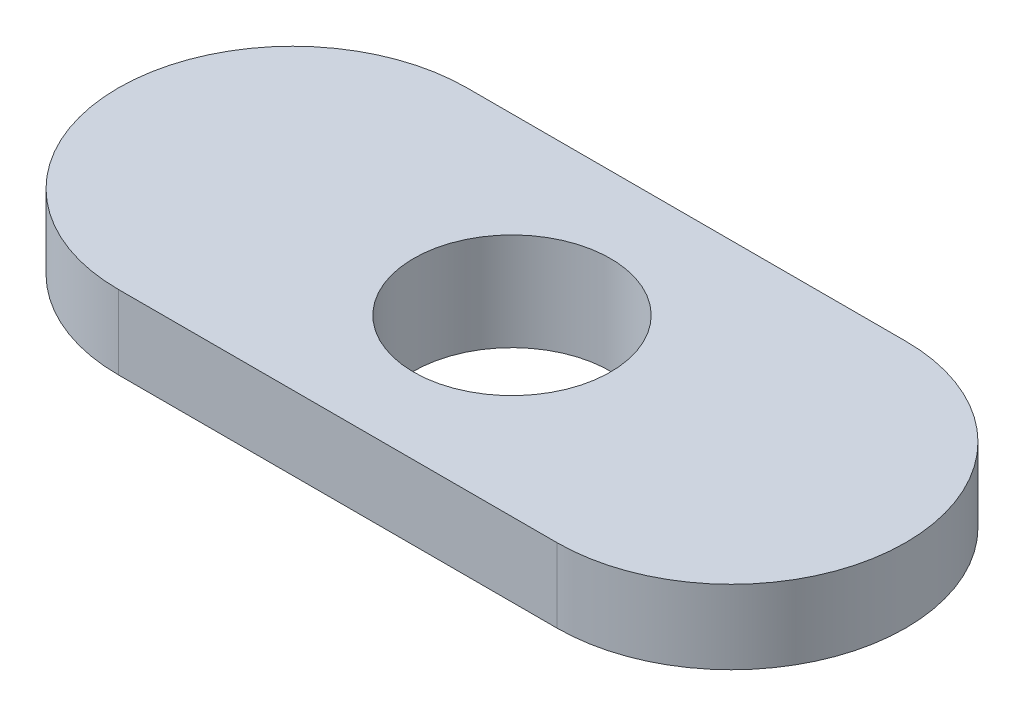
ISO-10303-21;
HEADER;
FILE_DESCRIPTION(('STEP AP214'),'2;1');
FILE_NAME('part.step','',(''),(''),'','','');
FILE_SCHEMA(('AUTOMOTIVE_DESIGN { 1 0 10303 214 1 1 1 1 }'));
ENDSEC;
DATA;
#1=APPLICATION_CONTEXT('core data for automotive mechanical design processes');
#2=APPLICATION_PROTOCOL_DEFINITION('international standard','automotive_design',2000,#1);
#3=PRODUCT_CONTEXT('',#1,'mechanical');
#4=PRODUCT('Part','Part','',(#3));
#5=PRODUCT_RELATED_PRODUCT_CATEGORY('part','',(#4));
#6=PRODUCT_DEFINITION_FORMATION('','',#4);
#7=PRODUCT_DEFINITION_CONTEXT('part definition',#1,'design');
#8=PRODUCT_DEFINITION('design','',#6,#7);
#9=PRODUCT_DEFINITION_SHAPE('','',#8);
#10=(LENGTH_UNIT() NAMED_UNIT(*) SI_UNIT(.MILLI.,.METRE.));
#11=(NAMED_UNIT(*) PLANE_ANGLE_UNIT() SI_UNIT($,.RADIAN.));
#12=(NAMED_UNIT(*) SI_UNIT($,.STERADIAN.) SOLID_ANGLE_UNIT());
#13=UNCERTAINTY_MEASURE_WITH_UNIT(LENGTH_MEASURE(1.E-05),#10,'distance_accuracy_value','');
#14=(GEOMETRIC_REPRESENTATION_CONTEXT(3) GLOBAL_UNCERTAINTY_ASSIGNED_CONTEXT((#13)) GLOBAL_UNIT_ASSIGNED_CONTEXT((#10,
#11,#12)) REPRESENTATION_CONTEXT('',''));
#15=CARTESIAN_POINT('',(0.,0.,0.));
#16=DIRECTION('',(0.,0.,1.));
#17=DIRECTION('',(1.,0.,0.));
#18=AXIS2_PLACEMENT_3D('',#15,#16,#17);
#19=CARTESIAN_POINT('',(0.,-9.4996,0.));
#20=DIRECTION('',(0.,1.,0.));
#21=DIRECTION('',(0.,0.,1.));
#22=AXIS2_PLACEMENT_3D('',#19,#20,#21);
#23=CYLINDRICAL_SURFACE('',#22,3.5687);
#24=CARTESIAN_POINT('',(0.,-9.4996,0.));
#25=DIRECTION('',(0.,1.,0.));
#26=DIRECTION('',(0.,0.,1.));
#27=AXIS2_PLACEMENT_3D('',#24,#25,#26);
#28=CIRCLE('',#27,3.5687);
#29=CARTESIAN_POINT('',(0.,-9.4996,3.5687));
#30=VERTEX_POINT('',#29);
#31=EDGE_CURVE('E21',#30,#30,#28,.F.);
#32=ORIENTED_EDGE('',*,*,#31,.F.);
#33=EDGE_LOOP('',(#32));
#34=FACE_BOUND('',#33,.T.);
#35=CARTESIAN_POINT('',(0.,-8.7376,0.));
#36=DIRECTION('',(0.,1.,0.));
#37=DIRECTION('',(0.,0.,1.));
#38=AXIS2_PLACEMENT_3D('',#35,#36,#37);
#39=CIRCLE('',#38,3.5687);
#40=CARTESIAN_POINT('',(0.,-8.7376,3.5687));
#41=VERTEX_POINT('',#40);
#42=EDGE_CURVE('E115',#41,#41,#39,.F.);
#43=ORIENTED_EDGE('',*,*,#42,.T.);
#44=EDGE_LOOP('',(#43));
#45=FACE_BOUND('',#44,.T.);
#46=ADVANCED_FACE('F18',(#34,#45),#23,.T.);
#47=CARTESIAN_POINT('',(0.,-9.4996,0.));
#48=DIRECTION('',(0.,-1.,0.));
#49=DIRECTION('',(0.,0.,-1.));
#50=AXIS2_PLACEMENT_3D('',#47,#48,#49);
#51=PLANE('',#50);
#52=CARTESIAN_POINT('',(0.,-9.4996,0.));
#53=DIRECTION('',(0.,1.,0.));
#54=DIRECTION('',(0.,0.,1.));
#55=AXIS2_PLACEMENT_3D('',#52,#53,#54);
#56=CIRCLE('',#55,3.175);
#57=CARTESIAN_POINT('',(0.,-9.4996,3.175));
#58=VERTEX_POINT('',#57);
#59=EDGE_CURVE('E77',#58,#58,#56,.T.);
#60=ORIENTED_EDGE('',*,*,#59,.T.);
#61=EDGE_LOOP('',(#60));
#62=FACE_BOUND('',#61,.T.);
#63=ORIENTED_EDGE('',*,*,#31,.T.);
#64=EDGE_LOOP('',(#63));
#65=FACE_BOUND('',#64,.T.);
#66=ADVANCED_FACE('F126',(#62,#65),#51,.T.);
#67=CARTESIAN_POINT('',(-7.0739,-8.7376,0.));
#68=DIRECTION('',(0.,1.,0.));
#69=DIRECTION('',(0.,0.,1.));
#70=AXIS2_PLACEMENT_3D('',#67,#68,#69);
#71=PLANE('',#70);
#72=ORIENTED_EDGE('',*,*,#42,.F.);
#73=EDGE_LOOP('',(#72));
#74=FACE_BOUND('',#73,.T.);
#75=DIRECTION('',(-1.,0.,0.));
#76=VECTOR('',#75,1.);
#77=CARTESIAN_POINT('',(-7.0739,-8.7376,-5.6261));
#78=LINE('',#77,#76);
#79=CARTESIAN_POINT('',(7.0739,-8.7376,-5.6261));
#80=VERTEX_POINT('',#79);
#81=CARTESIAN_POINT('',(-7.0739,-8.7376,-5.6261));
#82=VERTEX_POINT('',#81);
#83=EDGE_CURVE('E71',#80,#82,#78,.T.);
#84=ORIENTED_EDGE('',*,*,#83,.F.);
#85=CARTESIAN_POINT('',(7.0739,-8.7376,0.));
#86=DIRECTION('',(0.,1.,0.));
#87=DIRECTION('',(0.,0.,1.));
#88=AXIS2_PLACEMENT_3D('',#85,#86,#87);
#89=CIRCLE('',#88,5.6261);
#90=CARTESIAN_POINT('',(7.0739,-8.7376,5.6261));
#91=VERTEX_POINT('',#90);
#92=EDGE_CURVE('E95',#91,#80,#89,.T.);
#93=ORIENTED_EDGE('',*,*,#92,.F.);
#94=DIRECTION('',(1.,0.,0.));
#95=VECTOR('',#94,1.);
#96=CARTESIAN_POINT('',(-7.0739,-8.7376,5.6261));
#97=LINE('',#96,#95);
#98=CARTESIAN_POINT('',(-7.0739,-8.7376,5.6261));
#99=VERTEX_POINT('',#98);
#100=EDGE_CURVE('E72',#99,#91,#97,.T.);
#101=ORIENTED_EDGE('',*,*,#100,.F.);
#102=CARTESIAN_POINT('',(-7.0739,-8.7376,0.));
#103=DIRECTION('',(0.,1.,0.));
#104=DIRECTION('',(0.,0.,1.));
#105=AXIS2_PLACEMENT_3D('',#102,#103,#104);
#106=CIRCLE('',#105,5.6261);
#107=EDGE_CURVE('E66',#82,#99,#106,.T.);
#108=ORIENTED_EDGE('',*,*,#107,.F.);
#109=EDGE_LOOP('',(#84,#93,#101,#108));
#110=FACE_BOUND('',#109,.T.);
#111=ADVANCED_FACE('F68',(#74,#110),#71,.F.);
#112=CARTESIAN_POINT('',(0.,-8.7376,0.));
#113=DIRECTION('',(0.,1.,0.));
#114=DIRECTION('',(0.,0.,1.));
#115=AXIS2_PLACEMENT_3D('',#112,#113,#114);
#116=CYLINDRICAL_SURFACE('',#115,3.175);
#117=CARTESIAN_POINT('',(0.,-6.35,0.));
#118=DIRECTION('',(0.,1.,0.));
#119=DIRECTION('',(0.,0.,1.));
#120=AXIS2_PLACEMENT_3D('',#117,#118,#119);
#121=CIRCLE('',#120,3.175);
#122=CARTESIAN_POINT('',(0.,-6.35,3.175));
#123=VERTEX_POINT('',#122);
#124=EDGE_CURVE('E86',#123,#123,#121,.F.);
#125=ORIENTED_EDGE('',*,*,#124,.F.);
#126=EDGE_LOOP('',(#125));
#127=FACE_BOUND('',#126,.T.);
#128=ORIENTED_EDGE('',*,*,#59,.F.);
#129=EDGE_LOOP('',(#128));
#130=FACE_BOUND('',#129,.T.);
#131=ADVANCED_FACE('F153',(#127,#130),#116,.F.);
#132=CARTESIAN_POINT('',(-7.0739,-8.7376,0.));
#133=DIRECTION('',(0.,1.,0.));
#134=DIRECTION('',(0.,0.,1.));
#135=AXIS2_PLACEMENT_3D('',#132,#133,#134);
#136=CYLINDRICAL_SURFACE('',#135,5.6261);
#137=ORIENTED_EDGE('',*,*,#107,.T.);
#138=DIRECTION('',(0.,1.,0.));
#139=VECTOR('',#138,1.);
#140=CARTESIAN_POINT('',(-7.0739,-8.7376,5.6261));
#141=LINE('',#140,#139);
#142=CARTESIAN_POINT('',(-7.0739,-6.35,5.6261));
#143=VERTEX_POINT('',#142);
#144=EDGE_CURVE('E76',#143,#99,#141,.F.);
#145=ORIENTED_EDGE('',*,*,#144,.F.);
#146=CARTESIAN_POINT('',(-7.0739,-6.35,0.));
#147=DIRECTION('',(0.,1.,0.));
#148=DIRECTION('',(0.,0.,1.));
#149=AXIS2_PLACEMENT_3D('',#146,#147,#148);
#150=CIRCLE('',#149,5.6261);
#151=CARTESIAN_POINT('',(-7.0739,-6.35,-5.6261));
#152=VERTEX_POINT('',#151);
#153=EDGE_CURVE('E83',#152,#143,#150,.T.);
#154=ORIENTED_EDGE('',*,*,#153,.F.);
#155=DIRECTION('',(0.,1.,0.));
#156=VECTOR('',#155,1.);
#157=CARTESIAN_POINT('',(-7.0739,-8.7376,-5.6261));
#158=LINE('',#157,#156);
#159=EDGE_CURVE('E80',#82,#152,#158,.T.);
#160=ORIENTED_EDGE('',*,*,#159,.F.);
#161=EDGE_LOOP('',(#137,#145,#154,#160));
#162=FACE_BOUND('',#161,.T.);
#163=ADVANCED_FACE('F81',(#162),#136,.T.);
#164=CARTESIAN_POINT('',(-7.0739,-8.7376,5.6261));
#165=DIRECTION('',(0.,0.,1.));
#166=DIRECTION('',(1.,0.,0.));
#167=AXIS2_PLACEMENT_3D('',#164,#165,#166);
#168=PLANE('',#167);
#169=ORIENTED_EDGE('',*,*,#100,.T.);
#170=DIRECTION('',(0.,1.,0.));
#171=VECTOR('',#170,1.);
#172=CARTESIAN_POINT('',(7.0739,-8.7376,5.6261));
#173=LINE('',#172,#171);
#174=CARTESIAN_POINT('',(7.0739,-6.35,5.6261));
#175=VERTEX_POINT('',#174);
#176=EDGE_CURVE('E102',#175,#91,#173,.F.);
#177=ORIENTED_EDGE('',*,*,#176,.F.);
#178=DIRECTION('',(1.,0.,0.));
#179=VECTOR('',#178,1.);
#180=CARTESIAN_POINT('',(-7.0739,-6.35,5.6261));
#181=LINE('',#180,#179);
#182=EDGE_CURVE('E106',#143,#175,#181,.T.);
#183=ORIENTED_EDGE('',*,*,#182,.F.);
#184=ORIENTED_EDGE('',*,*,#144,.T.);
#185=EDGE_LOOP('',(#169,#177,#183,#184));
#186=FACE_BOUND('',#185,.T.);
#187=ADVANCED_FACE('F147',(#186),#168,.T.);
#188=CARTESIAN_POINT('',(7.0739,-8.7376,0.));
#189=DIRECTION('',(0.,1.,0.));
#190=DIRECTION('',(0.,0.,1.));
#191=AXIS2_PLACEMENT_3D('',#188,#189,#190);
#192=CYLINDRICAL_SURFACE('',#191,5.6261);
#193=ORIENTED_EDGE('',*,*,#92,.T.);
#194=DIRECTION('',(0.,1.,0.));
#195=VECTOR('',#194,1.);
#196=CARTESIAN_POINT('',(7.0739,-8.7376,-5.6261));
#197=LINE('',#196,#195);
#198=CARTESIAN_POINT('',(7.0739,-6.35,-5.6261));
#199=VERTEX_POINT('',#198);
#200=EDGE_CURVE('E40',#199,#80,#197,.F.);
#201=ORIENTED_EDGE('',*,*,#200,.F.);
#202=CARTESIAN_POINT('',(7.0739,-6.35,0.));
#203=DIRECTION('',(0.,1.,0.));
#204=DIRECTION('',(0.,0.,1.));
#205=AXIS2_PLACEMENT_3D('',#202,#203,#204);
#206=CIRCLE('',#205,5.6261);
#207=EDGE_CURVE('E28',#175,#199,#206,.T.);
#208=ORIENTED_EDGE('',*,*,#207,.F.);
#209=ORIENTED_EDGE('',*,*,#176,.T.);
#210=EDGE_LOOP('',(#193,#201,#208,#209));
#211=FACE_BOUND('',#210,.T.);
#212=ADVANCED_FACE('F141',(#211),#192,.T.);
#213=CARTESIAN_POINT('',(-7.0739,-8.7376,-5.6261));
#214=DIRECTION('',(0.,0.,-1.));
#215=DIRECTION('',(-1.,0.,0.));
#216=AXIS2_PLACEMENT_3D('',#213,#214,#215);
#217=PLANE('',#216);
#218=ORIENTED_EDGE('',*,*,#83,.T.);
#219=ORIENTED_EDGE('',*,*,#159,.T.);
#220=DIRECTION('',(1.,0.,0.));
#221=VECTOR('',#220,1.);
#222=CARTESIAN_POINT('',(-7.0739,-6.35,-5.6261));
#223=LINE('',#222,#221);
#224=EDGE_CURVE('E11',#199,#152,#223,.F.);
#225=ORIENTED_EDGE('',*,*,#224,.F.);
#226=ORIENTED_EDGE('',*,*,#200,.T.);
#227=EDGE_LOOP('',(#218,#219,#225,#226));
#228=FACE_BOUND('',#227,.T.);
#229=ADVANCED_FACE('F88',(#228),#217,.T.);
#230=CARTESIAN_POINT('',(-7.0739,-6.35,0.));
#231=DIRECTION('',(0.,1.,0.));
#232=DIRECTION('',(0.,0.,1.));
#233=AXIS2_PLACEMENT_3D('',#230,#231,#232);
#234=PLANE('',#233);
#235=ORIENTED_EDGE('',*,*,#207,.T.);
#236=ORIENTED_EDGE('',*,*,#224,.T.);
#237=ORIENTED_EDGE('',*,*,#153,.T.);
#238=ORIENTED_EDGE('',*,*,#182,.T.);
#239=EDGE_LOOP('',(#235,#236,#237,#238));
#240=FACE_BOUND('',#239,.T.);
#241=ORIENTED_EDGE('',*,*,#124,.T.);
#242=EDGE_LOOP('',(#241));
#243=FACE_BOUND('',#242,.T.);
#244=ADVANCED_FACE('F134',(#240,#243),#234,.T.);
#245=CLOSED_SHELL('',(#46,#66,#111,#131,#163,#187,#212,#229,#244));
#246=MANIFOLD_SOLID_BREP('B1',#245);
#247=ADVANCED_BREP_SHAPE_REPRESENTATION('',(#18,#246),#14);
#248=SHAPE_DEFINITION_REPRESENTATION(#9,#247);
ENDSEC;
END-ISO-10303-21;
